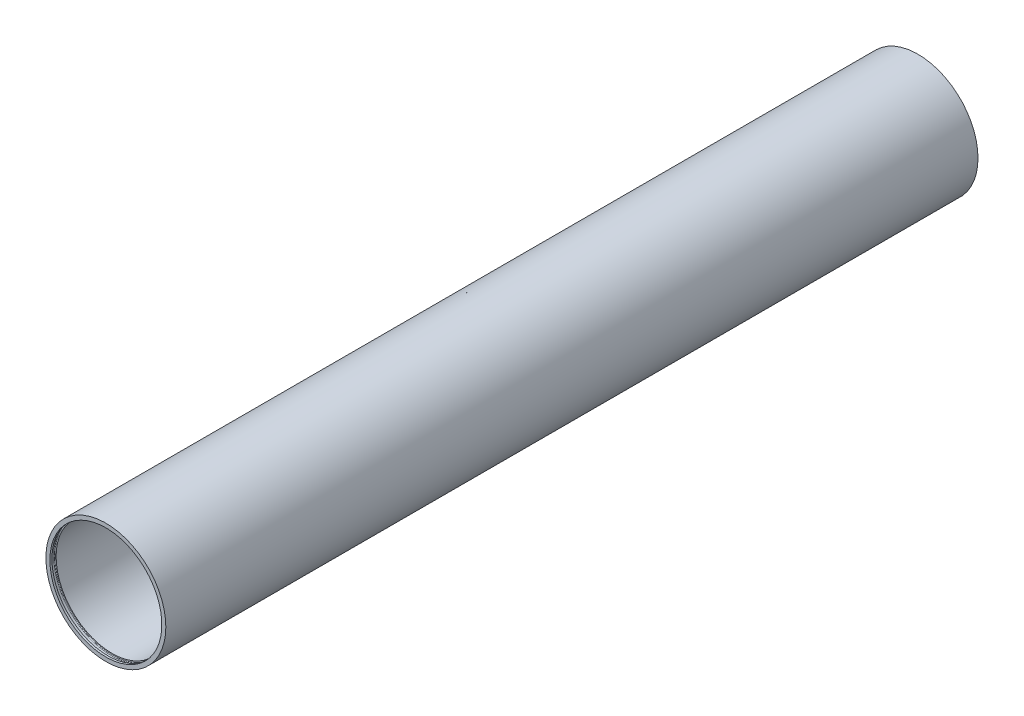
ISO-10303-21;
HEADER;
FILE_DESCRIPTION(('STEP AP214'),'2;1');
FILE_NAME('part.step','',(''),(''),'','','');
FILE_SCHEMA(('AUTOMOTIVE_DESIGN { 1 0 10303 214 1 1 1 1 }'));
ENDSEC;
DATA;
#1=APPLICATION_CONTEXT('core data for automotive mechanical design processes');
#2=APPLICATION_PROTOCOL_DEFINITION('international standard','automotive_design',2000,#1);
#3=PRODUCT_CONTEXT('',#1,'mechanical');
#4=PRODUCT('Part','Part','',(#3));
#5=PRODUCT_RELATED_PRODUCT_CATEGORY('part','',(#4));
#6=PRODUCT_DEFINITION_FORMATION('','',#4);
#7=PRODUCT_DEFINITION_CONTEXT('part definition',#1,'design');
#8=PRODUCT_DEFINITION('design','',#6,#7);
#9=PRODUCT_DEFINITION_SHAPE('','',#8);
#10=(LENGTH_UNIT() NAMED_UNIT(*) SI_UNIT(.MILLI.,.METRE.));
#11=(NAMED_UNIT(*) PLANE_ANGLE_UNIT() SI_UNIT($,.RADIAN.));
#12=(NAMED_UNIT(*) SI_UNIT($,.STERADIAN.) SOLID_ANGLE_UNIT());
#13=UNCERTAINTY_MEASURE_WITH_UNIT(LENGTH_MEASURE(1.E-05),#10,'distance_accuracy_value','');
#14=(GEOMETRIC_REPRESENTATION_CONTEXT(3) GLOBAL_UNCERTAINTY_ASSIGNED_CONTEXT((#13)) GLOBAL_UNIT_ASSIGNED_CONTEXT((#10,
#11,#12)) REPRESENTATION_CONTEXT('',''));
#15=CARTESIAN_POINT('',(0.,0.,0.));
#16=DIRECTION('',(0.,0.,1.));
#17=DIRECTION('',(1.,0.,0.));
#18=AXIS2_PLACEMENT_3D('',#15,#16,#17);
#19=CARTESIAN_POINT('',(0.,0.,507.84));
#20=DIRECTION('',(0.,0.,-1.));
#21=DIRECTION('',(-1.,0.,0.));
#22=AXIS2_PLACEMENT_3D('',#19,#20,#21);
#23=CYLINDRICAL_SURFACE('',#22,35.);
#24=CARTESIAN_POINT('',(0.,0.,507.84));
#25=DIRECTION('',(0.,0.,-1.));
#26=DIRECTION('',(-1.,0.,0.));
#27=AXIS2_PLACEMENT_3D('',#24,#25,#26);
#28=CIRCLE('',#27,35.);
#29=CARTESIAN_POINT('',(-35.,0.,507.84));
#30=VERTEX_POINT('',#29);
#31=EDGE_CURVE('E52',#30,#30,#28,.T.);
#32=ORIENTED_EDGE('',*,*,#31,.F.);
#33=EDGE_LOOP('',(#32));
#34=FACE_BOUND('',#33,.T.);
#35=CARTESIAN_POINT('',(0.,0.,506.57));
#36=DIRECTION('',(0.,0.,-1.));
#37=DIRECTION('',(-1.,0.,0.));
#38=AXIS2_PLACEMENT_3D('',#35,#36,#37);
#39=CIRCLE('',#38,35.);
#40=CARTESIAN_POINT('',(-35.,0.,506.57));
#41=VERTEX_POINT('',#40);
#42=EDGE_CURVE('E43',#41,#41,#39,.F.);
#43=ORIENTED_EDGE('',*,*,#42,.F.);
#44=EDGE_LOOP('',(#43));
#45=FACE_BOUND('',#44,.T.);
#46=ADVANCED_FACE('F39',(#34,#45),#23,.F.);
#47=CARTESIAN_POINT('',(0.,0.,3.87999999999999));
#48=DIRECTION('',(0.,0.,-1.));
#49=DIRECTION('',(-1.,0.,0.));
#50=AXIS2_PLACEMENT_3D('',#47,#48,#49);
#51=CIRCLE('',#50,35.);
#52=CARTESIAN_POINT('',(-35.,0.,3.87999999999999));
#53=VERTEX_POINT('',#52);
#54=EDGE_CURVE('E61',#53,#53,#51,.F.);
#55=ORIENTED_EDGE('',*,*,#54,.F.);
#56=EDGE_LOOP('',(#55));
#57=FACE_BOUND('',#56,.T.);
#58=CARTESIAN_POINT('',(0.,0.,503.96));
#59=DIRECTION('',(0.,0.,1.));
#60=DIRECTION('',(1.,0.,0.));
#61=AXIS2_PLACEMENT_3D('',#58,#59,#60);
#62=CIRCLE('',#61,35.);
#63=CARTESIAN_POINT('',(35.,0.,503.96));
#64=VERTEX_POINT('',#63);
#65=EDGE_CURVE('E64',#64,#64,#62,.F.);
#66=ORIENTED_EDGE('',*,*,#65,.F.);
#67=EDGE_LOOP('',(#66));
#68=FACE_BOUND('',#67,.T.);
#69=ADVANCED_FACE('F113',(#57,#68),#23,.F.);
#70=CARTESIAN_POINT('',(0.,0.,0.));
#71=DIRECTION('',(0.,0.,-1.));
#72=DIRECTION('',(-1.,0.,0.));
#73=AXIS2_PLACEMENT_3D('',#70,#71,#72);
#74=CIRCLE('',#73,35.);
#75=CARTESIAN_POINT('',(-35.,0.,0.));
#76=VERTEX_POINT('',#75);
#77=EDGE_CURVE('E55',#76,#76,#74,.T.);
#78=ORIENTED_EDGE('',*,*,#77,.T.);
#79=EDGE_LOOP('',(#78));
#80=FACE_BOUND('',#79,.T.);
#81=CARTESIAN_POINT('',(0.,0.,1.26999999999999));
#82=DIRECTION('',(0.,0.,1.));
#83=DIRECTION('',(1.,0.,0.));
#84=AXIS2_PLACEMENT_3D('',#81,#82,#83);
#85=CIRCLE('',#84,35.);
#86=CARTESIAN_POINT('',(35.,0.,1.26999999999999));
#87=VERTEX_POINT('',#86);
#88=EDGE_CURVE('E58',#87,#87,#85,.F.);
#89=ORIENTED_EDGE('',*,*,#88,.F.);
#90=EDGE_LOOP('',(#89));
#91=FACE_BOUND('',#90,.T.);
#92=ADVANCED_FACE('F96',(#80,#91),#23,.F.);
#93=CARTESIAN_POINT('',(0.,0.,507.84));
#94=DIRECTION('',(0.,0.,-1.));
#95=DIRECTION('',(-1.,0.,0.));
#96=AXIS2_PLACEMENT_3D('',#93,#94,#95);
#97=CYLINDRICAL_SURFACE('',#96,37.500000057);
#98=CARTESIAN_POINT('',(0.,0.,507.84));
#99=DIRECTION('',(0.,0.,1.));
#100=DIRECTION('',(1.,0.,0.));
#101=AXIS2_PLACEMENT_3D('',#98,#99,#100);
#102=CIRCLE('',#101,37.500000057);
#103=CARTESIAN_POINT('',(37.500000057,0.,507.84));
#104=VERTEX_POINT('',#103);
#105=EDGE_CURVE('E10',#104,#104,#102,.T.);
#106=ORIENTED_EDGE('',*,*,#105,.F.);
#107=EDGE_LOOP('',(#106));
#108=FACE_BOUND('',#107,.T.);
#109=CARTESIAN_POINT('',(0.,0.,0.));
#110=DIRECTION('',(0.,0.,1.));
#111=DIRECTION('',(1.,0.,0.));
#112=AXIS2_PLACEMENT_3D('',#109,#110,#111);
#113=CIRCLE('',#112,37.500000057);
#114=CARTESIAN_POINT('',(37.500000057,0.,0.));
#115=VERTEX_POINT('',#114);
#116=EDGE_CURVE('E47',#115,#115,#113,.T.);
#117=ORIENTED_EDGE('',*,*,#116,.T.);
#118=EDGE_LOOP('',(#117));
#119=FACE_BOUND('',#118,.T.);
#120=ADVANCED_FACE('F41',(#108,#119),#97,.T.);
#121=CARTESIAN_POINT('',(0.,0.,507.84));
#122=DIRECTION('',(0.,0.,1.));
#123=DIRECTION('',(1.,0.,0.));
#124=AXIS2_PLACEMENT_3D('',#121,#122,#123);
#125=PLANE('',#124);
#126=ORIENTED_EDGE('',*,*,#31,.T.);
#127=EDGE_LOOP('',(#126));
#128=FACE_BOUND('',#127,.T.);
#129=ORIENTED_EDGE('',*,*,#105,.T.);
#130=EDGE_LOOP('',(#129));
#131=FACE_BOUND('',#130,.T.);
#132=ADVANCED_FACE('F103',(#128,#131),#125,.T.);
#133=CARTESIAN_POINT('',(0.,0.,0.));
#134=DIRECTION('',(0.,0.,1.));
#135=DIRECTION('',(1.,0.,0.));
#136=AXIS2_PLACEMENT_3D('',#133,#134,#135);
#137=PLANE('',#136);
#138=ORIENTED_EDGE('',*,*,#77,.F.);
#139=EDGE_LOOP('',(#138));
#140=FACE_BOUND('',#139,.T.);
#141=ORIENTED_EDGE('',*,*,#116,.F.);
#142=EDGE_LOOP('',(#141));
#143=FACE_BOUND('',#142,.T.);
#144=ADVANCED_FACE('F99',(#140,#143),#137,.F.);
#145=CARTESIAN_POINT('',(0.,35.7,3.87999999999999));
#146=DIRECTION('',(0.,0.,-1.));
#147=DIRECTION('',(-1.,0.,0.));
#148=AXIS2_PLACEMENT_3D('',#145,#146,#147);
#149=PLANE('',#148);
#150=CARTESIAN_POINT('',(0.,0.,3.87999999999999));
#151=DIRECTION('',(0.,0.,-1.));
#152=DIRECTION('',(-1.,0.,0.));
#153=AXIS2_PLACEMENT_3D('',#150,#151,#152);
#154=CIRCLE('',#153,35.7);
#155=CARTESIAN_POINT('',(-35.7,0.,3.87999999999999));
#156=VERTEX_POINT('',#155);
#157=EDGE_CURVE('E62',#156,#156,#154,.T.);
#158=ORIENTED_EDGE('',*,*,#157,.T.);
#159=EDGE_LOOP('',(#158));
#160=FACE_BOUND('',#159,.T.);
#161=ORIENTED_EDGE('',*,*,#54,.T.);
#162=EDGE_LOOP('',(#161));
#163=FACE_BOUND('',#162,.T.);
#164=ADVANCED_FACE('F102',(#160,#163),#149,.T.);
#165=CARTESIAN_POINT('',(0.,31.5,1.26999999999998));
#166=DIRECTION('',(0.,0.,1.));
#167=DIRECTION('',(1.,0.,0.));
#168=AXIS2_PLACEMENT_3D('',#165,#166,#167);
#169=PLANE('',#168);
#170=CARTESIAN_POINT('',(0.,0.,1.26999999999999));
#171=DIRECTION('',(0.,0.,-1.));
#172=DIRECTION('',(-1.,0.,0.));
#173=AXIS2_PLACEMENT_3D('',#170,#171,#172);
#174=CIRCLE('',#173,35.7);
#175=CARTESIAN_POINT('',(-35.7,0.,1.26999999999999));
#176=VERTEX_POINT('',#175);
#177=EDGE_CURVE('E70',#176,#176,#174,.T.);
#178=ORIENTED_EDGE('',*,*,#177,.F.);
#179=EDGE_LOOP('',(#178));
#180=FACE_BOUND('',#179,.T.);
#181=ORIENTED_EDGE('',*,*,#88,.T.);
#182=EDGE_LOOP('',(#181));
#183=FACE_BOUND('',#182,.T.);
#184=ADVANCED_FACE('F125',(#180,#183),#169,.T.);
#185=CARTESIAN_POINT('',(0.,0.,3.48000000000004));
#186=DIRECTION('',(0.,0.,-1.));
#187=DIRECTION('',(-1.,0.,0.));
#188=AXIS2_PLACEMENT_3D('',#185,#186,#187);
#189=TOROIDAL_SURFACE('',#188,35.7,0.399999999999977);
#190=CARTESIAN_POINT('',(0.,0.,3.48000000000004));
#191=DIRECTION('',(0.,0.,-1.));
#192=DIRECTION('',(-1.,0.,0.));
#193=AXIS2_PLACEMENT_3D('',#190,#191,#192);
#194=CIRCLE('',#193,36.1);
#195=CARTESIAN_POINT('',(-36.1,0.,3.48000000000004));
#196=VERTEX_POINT('',#195);
#197=EDGE_CURVE('E86',#196,#196,#194,.T.);
#198=ORIENTED_EDGE('',*,*,#197,.T.);
#199=EDGE_LOOP('',(#198));
#200=FACE_BOUND('',#199,.T.);
#201=ORIENTED_EDGE('',*,*,#157,.F.);
#202=EDGE_LOOP('',(#201));
#203=FACE_BOUND('',#202,.T.);
#204=ADVANCED_FACE('F127',(#200,#203),#189,.F.);
#205=CARTESIAN_POINT('',(0.,0.,557.84));
#206=DIRECTION('',(0.,0.,-1.));
#207=DIRECTION('',(-1.,0.,0.));
#208=AXIS2_PLACEMENT_3D('',#205,#206,#207);
#209=CYLINDRICAL_SURFACE('',#208,36.1);
#210=CARTESIAN_POINT('',(0.,0.,1.66999999999995));
#211=DIRECTION('',(0.,0.,-1.));
#212=DIRECTION('',(-1.,0.,0.));
#213=AXIS2_PLACEMENT_3D('',#210,#211,#212);
#214=CIRCLE('',#213,36.1);
#215=CARTESIAN_POINT('',(-36.1,0.,1.66999999999995));
#216=VERTEX_POINT('',#215);
#217=EDGE_CURVE('E83',#216,#216,#214,.T.);
#218=ORIENTED_EDGE('',*,*,#217,.T.);
#219=EDGE_LOOP('',(#218));
#220=FACE_BOUND('',#219,.T.);
#221=ORIENTED_EDGE('',*,*,#197,.F.);
#222=EDGE_LOOP('',(#221));
#223=FACE_BOUND('',#222,.T.);
#224=ADVANCED_FACE('F130',(#220,#223),#209,.F.);
#225=CARTESIAN_POINT('',(0.,0.,1.66999999999995));
#226=DIRECTION('',(0.,0.,-1.));
#227=DIRECTION('',(-1.,0.,0.));
#228=AXIS2_PLACEMENT_3D('',#225,#226,#227);
#229=TOROIDAL_SURFACE('',#228,35.7,0.399999999999977);
#230=ORIENTED_EDGE('',*,*,#177,.T.);
#231=EDGE_LOOP('',(#230));
#232=FACE_BOUND('',#231,.T.);
#233=ORIENTED_EDGE('',*,*,#217,.F.);
#234=EDGE_LOOP('',(#233));
#235=FACE_BOUND('',#234,.T.);
#236=ADVANCED_FACE('F134',(#232,#235),#229,.F.);
#237=CARTESIAN_POINT('',(0.,35.7,506.57));
#238=DIRECTION('',(0.,0.,-1.));
#239=DIRECTION('',(-1.,0.,0.));
#240=AXIS2_PLACEMENT_3D('',#237,#238,#239);
#241=PLANE('',#240);
#242=CARTESIAN_POINT('',(0.,0.,506.57));
#243=DIRECTION('',(0.,0.,-1.));
#244=DIRECTION('',(-1.,0.,0.));
#245=AXIS2_PLACEMENT_3D('',#242,#243,#244);
#246=CIRCLE('',#245,35.7);
#247=CARTESIAN_POINT('',(-35.7,0.,506.57));
#248=VERTEX_POINT('',#247);
#249=EDGE_CURVE('E66',#248,#248,#246,.T.);
#250=ORIENTED_EDGE('',*,*,#249,.T.);
#251=EDGE_LOOP('',(#250));
#252=FACE_BOUND('',#251,.T.);
#253=ORIENTED_EDGE('',*,*,#42,.T.);
#254=EDGE_LOOP('',(#253));
#255=FACE_BOUND('',#254,.T.);
#256=ADVANCED_FACE('F138',(#252,#255),#241,.T.);
#257=CARTESIAN_POINT('',(0.,31.5,503.96));
#258=DIRECTION('',(0.,0.,1.));
#259=DIRECTION('',(1.,0.,0.));
#260=AXIS2_PLACEMENT_3D('',#257,#258,#259);
#261=PLANE('',#260);
#262=CARTESIAN_POINT('',(0.,0.,503.96));
#263=DIRECTION('',(0.,0.,-1.));
#264=DIRECTION('',(-1.,0.,0.));
#265=AXIS2_PLACEMENT_3D('',#262,#263,#264);
#266=CIRCLE('',#265,35.7);
#267=CARTESIAN_POINT('',(-35.7,0.,503.96));
#268=VERTEX_POINT('',#267);
#269=EDGE_CURVE('E164',#268,#268,#266,.T.);
#270=ORIENTED_EDGE('',*,*,#269,.F.);
#271=EDGE_LOOP('',(#270));
#272=FACE_BOUND('',#271,.T.);
#273=ORIENTED_EDGE('',*,*,#65,.T.);
#274=EDGE_LOOP('',(#273));
#275=FACE_BOUND('',#274,.T.);
#276=ADVANCED_FACE('F145',(#272,#275),#261,.T.);
#277=CARTESIAN_POINT('',(0.,0.,506.17));
#278=DIRECTION('',(0.,0.,-1.));
#279=DIRECTION('',(-1.,0.,0.));
#280=AXIS2_PLACEMENT_3D('',#277,#278,#279);
#281=TOROIDAL_SURFACE('',#280,35.7,0.399999999999977);
#282=CARTESIAN_POINT('',(0.,0.,506.17));
#283=DIRECTION('',(0.,0.,-1.));
#284=DIRECTION('',(-1.,0.,0.));
#285=AXIS2_PLACEMENT_3D('',#282,#283,#284);
#286=CIRCLE('',#285,36.1);
#287=CARTESIAN_POINT('',(-36.1,0.,506.17));
#288=VERTEX_POINT('',#287);
#289=EDGE_CURVE('E72',#288,#288,#286,.T.);
#290=ORIENTED_EDGE('',*,*,#289,.T.);
#291=EDGE_LOOP('',(#290));
#292=FACE_BOUND('',#291,.T.);
#293=ORIENTED_EDGE('',*,*,#249,.F.);
#294=EDGE_LOOP('',(#293));
#295=FACE_BOUND('',#294,.T.);
#296=ADVANCED_FACE('F146',(#292,#295),#281,.F.);
#297=CARTESIAN_POINT('',(0.,0.,557.84));
#298=DIRECTION('',(0.,0.,-1.));
#299=DIRECTION('',(-1.,0.,0.));
#300=AXIS2_PLACEMENT_3D('',#297,#298,#299);
#301=CYLINDRICAL_SURFACE('',#300,36.1);
#302=CARTESIAN_POINT('',(0.,0.,504.36));
#303=DIRECTION('',(0.,0.,-1.));
#304=DIRECTION('',(-1.,0.,0.));
#305=AXIS2_PLACEMENT_3D('',#302,#303,#304);
#306=CIRCLE('',#305,36.1);
#307=CARTESIAN_POINT('',(-36.1,0.,504.36));
#308=VERTEX_POINT('',#307);
#309=EDGE_CURVE('E77',#308,#308,#306,.T.);
#310=ORIENTED_EDGE('',*,*,#309,.T.);
#311=EDGE_LOOP('',(#310));
#312=FACE_BOUND('',#311,.T.);
#313=ORIENTED_EDGE('',*,*,#289,.F.);
#314=EDGE_LOOP('',(#313));
#315=FACE_BOUND('',#314,.T.);
#316=ADVANCED_FACE('F149',(#312,#315),#301,.F.);
#317=CARTESIAN_POINT('',(0.,0.,504.36));
#318=DIRECTION('',(0.,0.,-1.));
#319=DIRECTION('',(-1.,0.,0.));
#320=AXIS2_PLACEMENT_3D('',#317,#318,#319);
#321=TOROIDAL_SURFACE('',#320,35.7,0.399999999999977);
#322=ORIENTED_EDGE('',*,*,#269,.T.);
#323=EDGE_LOOP('',(#322));
#324=FACE_BOUND('',#323,.T.);
#325=ORIENTED_EDGE('',*,*,#309,.F.);
#326=EDGE_LOOP('',(#325));
#327=FACE_BOUND('',#326,.T.);
#328=ADVANCED_FACE('F153',(#324,#327),#321,.F.);
#329=CLOSED_SHELL('',(#46,#69,#92,#120,#132,#144,#164,#184,#204,#224,#236,#256,#276,#296,#316,#328));
#330=MANIFOLD_SOLID_BREP('B2',#329);
#331=ADVANCED_BREP_SHAPE_REPRESENTATION('',(#18,#330),#14);
#332=SHAPE_DEFINITION_REPRESENTATION(#9,#331);
ENDSEC;
END-ISO-10303-21;
